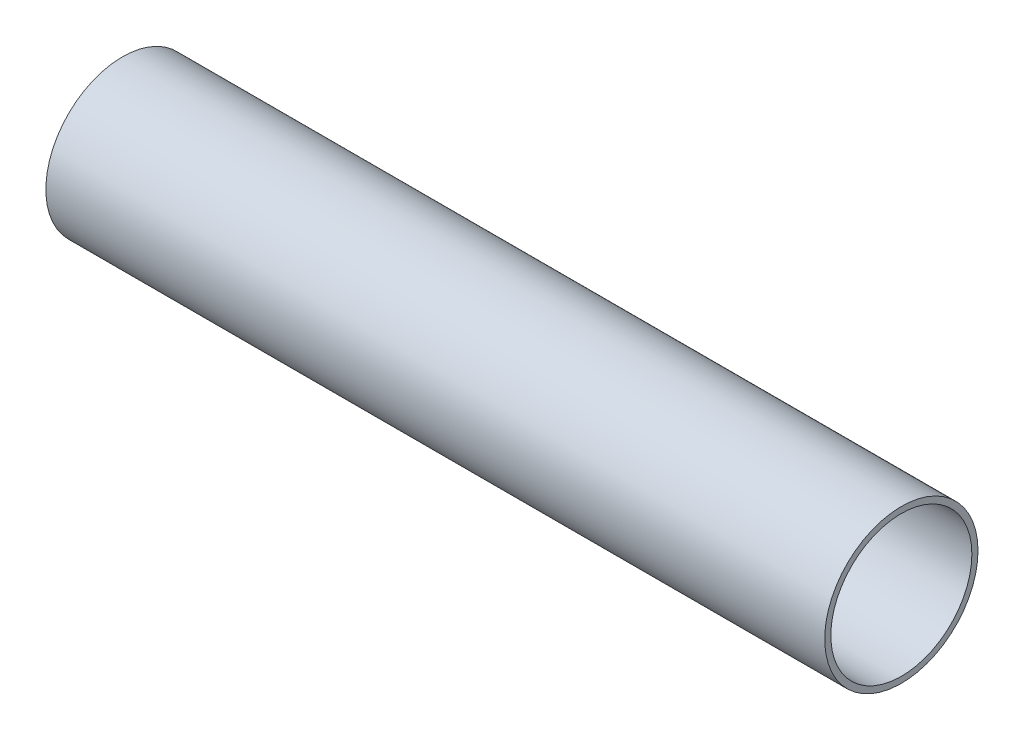
ISO-10303-21;
HEADER;
FILE_DESCRIPTION(('STEP AP214'),'2;1');
FILE_NAME('part.step','',(''),(''),'','','');
FILE_SCHEMA(('AUTOMOTIVE_DESIGN { 1 0 10303 214 1 1 1 1 }'));
ENDSEC;
DATA;
#1=APPLICATION_CONTEXT('core data for automotive mechanical design processes');
#2=APPLICATION_PROTOCOL_DEFINITION('international standard','automotive_design',2000,#1);
#3=PRODUCT_CONTEXT('',#1,'mechanical');
#4=PRODUCT('Part','Part','',(#3));
#5=PRODUCT_RELATED_PRODUCT_CATEGORY('part','',(#4));
#6=PRODUCT_DEFINITION_FORMATION('','',#4);
#7=PRODUCT_DEFINITION_CONTEXT('part definition',#1,'design');
#8=PRODUCT_DEFINITION('design','',#6,#7);
#9=PRODUCT_DEFINITION_SHAPE('','',#8);
#10=(LENGTH_UNIT() NAMED_UNIT(*) SI_UNIT(.MILLI.,.METRE.));
#11=(NAMED_UNIT(*) PLANE_ANGLE_UNIT() SI_UNIT($,.RADIAN.));
#12=(NAMED_UNIT(*) SI_UNIT($,.STERADIAN.) SOLID_ANGLE_UNIT());
#13=UNCERTAINTY_MEASURE_WITH_UNIT(LENGTH_MEASURE(1.E-05),#10,'distance_accuracy_value','');
#14=(GEOMETRIC_REPRESENTATION_CONTEXT(3) GLOBAL_UNCERTAINTY_ASSIGNED_CONTEXT((#13)) GLOBAL_UNIT_ASSIGNED_CONTEXT((#10,
#11,#12)) REPRESENTATION_CONTEXT('',''));
#15=CARTESIAN_POINT('',(0.,0.,0.));
#16=DIRECTION('',(0.,0.,1.));
#17=DIRECTION('',(1.,0.,0.));
#18=AXIS2_PLACEMENT_3D('',#15,#16,#17);
#19=CARTESIAN_POINT('',(127.,0.,0.));
#20=DIRECTION('',(1.,0.,0.));
#21=DIRECTION('',(0.,0.,-1.));
#22=AXIS2_PLACEMENT_3D('',#19,#20,#21);
#23=PLANE('',#22);
#24=CARTESIAN_POINT('',(127.,0.,0.));
#25=DIRECTION('',(1.,0.,0.));
#26=DIRECTION('',(0.,0.,-1.));
#27=AXIS2_PLACEMENT_3D('',#24,#25,#26);
#28=CIRCLE('',#27,12.5);
#29=CARTESIAN_POINT('',(127.,0.,-12.5));
#30=VERTEX_POINT('',#29);
#31=EDGE_CURVE('E10',#30,#30,#28,.T.);
#32=ORIENTED_EDGE('',*,*,#31,.T.);
#33=EDGE_LOOP('',(#32));
#34=FACE_BOUND('',#33,.T.);
#35=CARTESIAN_POINT('',(127.,0.,0.));
#36=DIRECTION('',(1.,0.,0.));
#37=DIRECTION('',(0.,0.,-1.));
#38=AXIS2_PLACEMENT_3D('',#35,#36,#37);
#39=CIRCLE('',#38,11.5);
#40=CARTESIAN_POINT('',(127.,0.,-11.5));
#41=VERTEX_POINT('',#40);
#42=EDGE_CURVE('E60',#41,#41,#39,.T.);
#43=ORIENTED_EDGE('',*,*,#42,.F.);
#44=EDGE_LOOP('',(#43));
#45=FACE_BOUND('',#44,.T.);
#46=ADVANCED_FACE('F47',(#34,#45),#23,.T.);
#47=CARTESIAN_POINT('',(0.,0.,0.));
#48=DIRECTION('',(1.,0.,0.));
#49=DIRECTION('',(0.,0.,-1.));
#50=AXIS2_PLACEMENT_3D('',#47,#48,#49);
#51=PLANE('',#50);
#52=CARTESIAN_POINT('',(0.,0.,0.));
#53=DIRECTION('',(1.,0.,0.));
#54=DIRECTION('',(0.,0.,-1.));
#55=AXIS2_PLACEMENT_3D('',#52,#53,#54);
#56=CIRCLE('',#55,12.5);
#57=CARTESIAN_POINT('',(0.,0.,-12.5));
#58=VERTEX_POINT('',#57);
#59=EDGE_CURVE('E51',#58,#58,#56,.T.);
#60=ORIENTED_EDGE('',*,*,#59,.F.);
#61=EDGE_LOOP('',(#60));
#62=FACE_BOUND('',#61,.T.);
#63=CARTESIAN_POINT('',(0.,0.,0.));
#64=DIRECTION('',(1.,0.,0.));
#65=DIRECTION('',(0.,0.,-1.));
#66=AXIS2_PLACEMENT_3D('',#63,#64,#65);
#67=CIRCLE('',#66,11.5);
#68=CARTESIAN_POINT('',(0.,0.,-11.5));
#69=VERTEX_POINT('',#68);
#70=EDGE_CURVE('E62',#69,#69,#67,.T.);
#71=ORIENTED_EDGE('',*,*,#70,.T.);
#72=EDGE_LOOP('',(#71));
#73=FACE_BOUND('',#72,.T.);
#74=ADVANCED_FACE('F74',(#62,#73),#51,.F.);
#75=CARTESIAN_POINT('',(127.,0.,0.));
#76=DIRECTION('',(-1.,0.,0.));
#77=DIRECTION('',(0.,0.,1.));
#78=AXIS2_PLACEMENT_3D('',#75,#76,#77);
#79=CYLINDRICAL_SURFACE('',#78,12.5);
#80=ORIENTED_EDGE('',*,*,#31,.F.);
#81=EDGE_LOOP('',(#80));
#82=FACE_BOUND('',#81,.T.);
#83=ORIENTED_EDGE('',*,*,#59,.T.);
#84=EDGE_LOOP('',(#83));
#85=FACE_BOUND('',#84,.T.);
#86=ADVANCED_FACE('F49',(#82,#85),#79,.T.);
#87=CARTESIAN_POINT('',(127.,0.,0.));
#88=DIRECTION('',(-1.,0.,0.));
#89=DIRECTION('',(0.,0.,1.));
#90=AXIS2_PLACEMENT_3D('',#87,#88,#89);
#91=CYLINDRICAL_SURFACE('',#90,11.5);
#92=ORIENTED_EDGE('',*,*,#42,.T.);
#93=EDGE_LOOP('',(#92));
#94=FACE_BOUND('',#93,.T.);
#95=ORIENTED_EDGE('',*,*,#70,.F.);
#96=EDGE_LOOP('',(#95));
#97=FACE_BOUND('',#96,.T.);
#98=ADVANCED_FACE('F70',(#94,#97),#91,.F.);
#99=CLOSED_SHELL('',(#46,#74,#86,#98));
#100=MANIFOLD_SOLID_BREP('B2',#99);
#101=ADVANCED_BREP_SHAPE_REPRESENTATION('',(#18,#100),#14);
#102=SHAPE_DEFINITION_REPRESENTATION(#9,#101);
ENDSEC;
END-ISO-10303-21;
